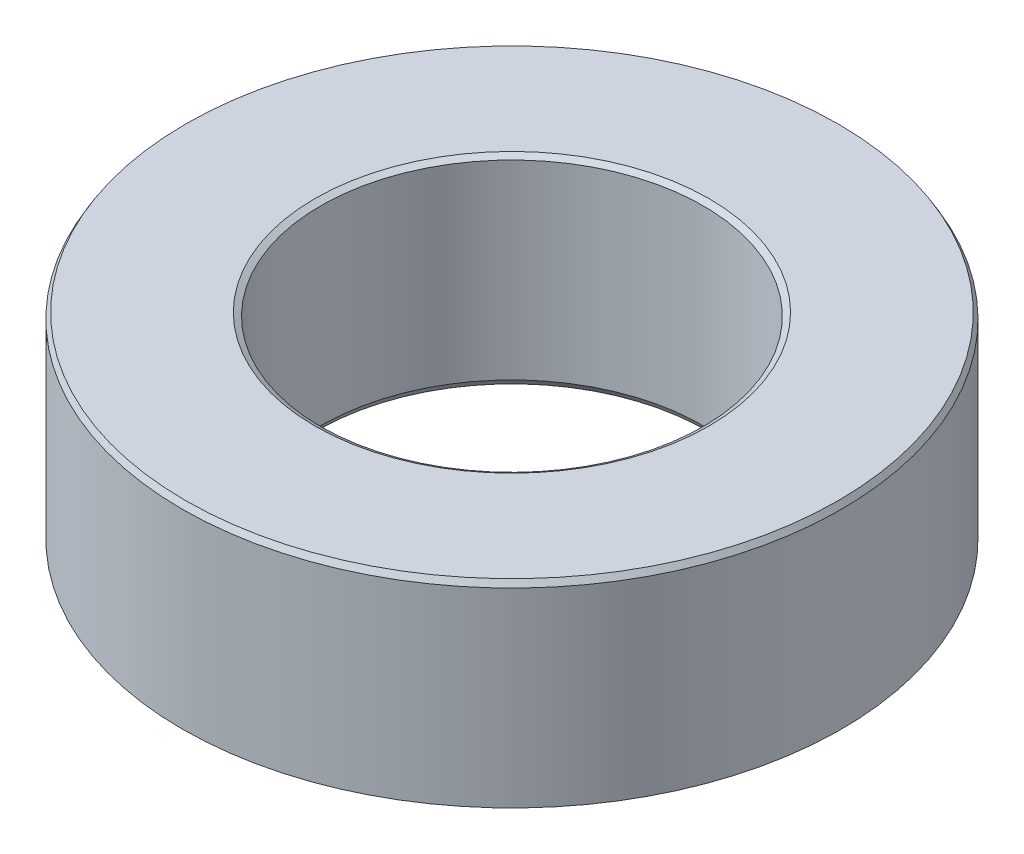
ISO-10303-21;
HEADER;
FILE_DESCRIPTION(('STEP AP214'),'2;1');
FILE_NAME('part.step','',(''),(''),'','','');
FILE_SCHEMA(('AUTOMOTIVE_DESIGN { 1 0 10303 214 1 1 1 1 }'));
ENDSEC;
DATA;
#1=APPLICATION_CONTEXT('core data for automotive mechanical design processes');
#2=APPLICATION_PROTOCOL_DEFINITION('international standard','automotive_design',2000,#1);
#3=PRODUCT_CONTEXT('',#1,'mechanical');
#4=PRODUCT('Part','Part','',(#3));
#5=PRODUCT_RELATED_PRODUCT_CATEGORY('part','',(#4));
#6=PRODUCT_DEFINITION_FORMATION('','',#4);
#7=PRODUCT_DEFINITION_CONTEXT('part definition',#1,'design');
#8=PRODUCT_DEFINITION('design','',#6,#7);
#9=PRODUCT_DEFINITION_SHAPE('','',#8);
#10=(LENGTH_UNIT() NAMED_UNIT(*) SI_UNIT(.MILLI.,.METRE.));
#11=(NAMED_UNIT(*) PLANE_ANGLE_UNIT() SI_UNIT($,.RADIAN.));
#12=(NAMED_UNIT(*) SI_UNIT($,.STERADIAN.) SOLID_ANGLE_UNIT());
#13=UNCERTAINTY_MEASURE_WITH_UNIT(LENGTH_MEASURE(1.E-05),#10,'distance_accuracy_value','');
#14=(GEOMETRIC_REPRESENTATION_CONTEXT(3) GLOBAL_UNCERTAINTY_ASSIGNED_CONTEXT((#13)) GLOBAL_UNIT_ASSIGNED_CONTEXT((#10,
#11,#12)) REPRESENTATION_CONTEXT('',''));
#15=CARTESIAN_POINT('',(0.,0.,0.));
#16=DIRECTION('',(0.,0.,1.));
#17=DIRECTION('',(1.,0.,0.));
#18=AXIS2_PLACEMENT_3D('',#15,#16,#17);
#19=CARTESIAN_POINT('',(0.,30.2769379676355,0.));
#20=DIRECTION('',(0.,-1.,0.));
#21=DIRECTION('',(0.,0.,-1.));
#22=AXIS2_PLACEMENT_3D('',#19,#20,#21);
#23=CYLINDRICAL_SURFACE('',#22,50.);
#24=CARTESIAN_POINT('',(0.,0.505990335931194,0.));
#25=DIRECTION('',(0.,1.,0.));
#26=DIRECTION('',(0.,0.,1.));
#27=AXIS2_PLACEMENT_3D('',#24,#25,#26);
#28=CIRCLE('',#27,50.);
#29=CARTESIAN_POINT('',(0.,0.505990335931194,50.));
#30=VERTEX_POINT('',#29);
#31=EDGE_CURVE('E10',#30,#30,#28,.T.);
#32=ORIENTED_EDGE('',*,*,#31,.T.);
#33=EDGE_LOOP('',(#32));
#34=FACE_BOUND('',#33,.T.);
#35=CARTESIAN_POINT('',(0.,29.4005369976638,0.));
#36=DIRECTION('',(0.,1.,0.));
#37=DIRECTION('',(0.,0.,1.));
#38=AXIS2_PLACEMENT_3D('',#35,#36,#37);
#39=CIRCLE('',#38,50.);
#40=CARTESIAN_POINT('',(0.,29.4005369976638,50.));
#41=VERTEX_POINT('',#40);
#42=EDGE_CURVE('E50',#41,#41,#39,.F.);
#43=ORIENTED_EDGE('',*,*,#42,.T.);
#44=EDGE_LOOP('',(#43));
#45=FACE_BOUND('',#44,.T.);
#46=ADVANCED_FACE('F39',(#34,#45),#23,.T.);
#47=CARTESIAN_POINT('',(0.,30.2769379676355,0.));
#48=DIRECTION('',(0.,1.,0.));
#49=DIRECTION('',(0.,0.,1.));
#50=AXIS2_PLACEMENT_3D('',#47,#48,#49);
#51=PLANE('',#50);
#52=CARTESIAN_POINT('',(0.,30.2769379676355,0.));
#53=DIRECTION('',(0.,1.,0.));
#54=DIRECTION('',(0.,0.,1.));
#55=AXIS2_PLACEMENT_3D('',#52,#53,#54);
#56=CIRCLE('',#55,29.89196064427);
#57=CARTESIAN_POINT('',(0.,30.2769379676355,29.89196064427));
#58=VERTEX_POINT('',#57);
#59=EDGE_CURVE('E58',#58,#58,#56,.F.);
#60=ORIENTED_EDGE('',*,*,#59,.T.);
#61=EDGE_LOOP('',(#60));
#62=FACE_BOUND('',#61,.T.);
#63=CARTESIAN_POINT('',(0.,30.2769379676355,0.));
#64=DIRECTION('',(0.,1.,0.));
#65=DIRECTION('',(0.,0.,1.));
#66=AXIS2_PLACEMENT_3D('',#63,#64,#65);
#67=CIRCLE('',#66,49.4940096640688);
#68=CARTESIAN_POINT('',(0.,30.2769379676355,49.4940096640688));
#69=VERTEX_POINT('',#68);
#70=EDGE_CURVE('E61',#69,#69,#67,.T.);
#71=ORIENTED_EDGE('',*,*,#70,.T.);
#72=EDGE_LOOP('',(#71));
#73=FACE_BOUND('',#72,.T.);
#74=ADVANCED_FACE('F88',(#62,#73),#51,.T.);
#75=CARTESIAN_POINT('',(0.,0.,0.));
#76=DIRECTION('',(0.,1.,0.));
#77=DIRECTION('',(0.,0.,1.));
#78=AXIS2_PLACEMENT_3D('',#75,#76,#77);
#79=PLANE('',#78);
#80=CARTESIAN_POINT('',(0.,0.,0.));
#81=DIRECTION('',(0.,1.,0.));
#82=DIRECTION('',(0.,0.,1.));
#83=AXIS2_PLACEMENT_3D('',#80,#81,#82);
#84=CIRCLE('',#83,29.5215500102294);
#85=CARTESIAN_POINT('',(0.,0.,29.5215500102294));
#86=VERTEX_POINT('',#85);
#87=EDGE_CURVE('E51',#86,#86,#84,.T.);
#88=ORIENTED_EDGE('',*,*,#87,.T.);
#89=EDGE_LOOP('',(#88));
#90=FACE_BOUND('',#89,.T.);
#91=CARTESIAN_POINT('',(0.,0.,0.));
#92=DIRECTION('',(0.,1.,0.));
#93=DIRECTION('',(0.,0.,1.));
#94=AXIS2_PLACEMENT_3D('',#91,#92,#93);
#95=CIRCLE('',#94,49.1235990300283);
#96=CARTESIAN_POINT('',(0.,0.,49.1235990300283));
#97=VERTEX_POINT('',#96);
#98=EDGE_CURVE('E54',#97,#97,#95,.F.);
#99=ORIENTED_EDGE('',*,*,#98,.T.);
#100=EDGE_LOOP('',(#99));
#101=FACE_BOUND('',#100,.T.);
#102=ADVANCED_FACE('F83',(#90,#101),#79,.F.);
#103=CARTESIAN_POINT('',(0.,30.2769379676355,0.));
#104=DIRECTION('',(0.,-1.,0.));
#105=DIRECTION('',(0.,0.,-1.));
#106=AXIS2_PLACEMENT_3D('',#103,#104,#105);
#107=CYLINDRICAL_SURFACE('',#106,29.0155596742982);
#108=CARTESIAN_POINT('',(0.,29.7709476317042,0.));
#109=DIRECTION('',(0.,1.,0.));
#110=DIRECTION('',(0.,0.,1.));
#111=AXIS2_PLACEMENT_3D('',#108,#109,#110);
#112=CIRCLE('',#111,29.0155596742982);
#113=CARTESIAN_POINT('',(0.,29.7709476317042,29.0155596742982));
#114=VERTEX_POINT('',#113);
#115=EDGE_CURVE('E67',#114,#114,#112,.T.);
#116=ORIENTED_EDGE('',*,*,#115,.T.);
#117=EDGE_LOOP('',(#116));
#118=FACE_BOUND('',#117,.T.);
#119=CARTESIAN_POINT('',(0.,0.876400969971672,0.));
#120=DIRECTION('',(0.,1.,0.));
#121=DIRECTION('',(0.,0.,1.));
#122=AXIS2_PLACEMENT_3D('',#119,#120,#121);
#123=CIRCLE('',#122,29.0155596742982);
#124=CARTESIAN_POINT('',(0.,0.876400969971672,29.0155596742982));
#125=VERTEX_POINT('',#124);
#126=EDGE_CURVE('E69',#125,#125,#123,.F.);
#127=ORIENTED_EDGE('',*,*,#126,.T.);
#128=EDGE_LOOP('',(#127));
#129=FACE_BOUND('',#128,.T.);
#130=ADVANCED_FACE('F71',(#118,#129),#107,.F.);
#131=CARTESIAN_POINT('',(0.,29.7709476317042,0.));
#132=DIRECTION('',(0.,1.,0.));
#133=DIRECTION('',(0.,0.,1.));
#134=AXIS2_PLACEMENT_3D('',#131,#132,#133);
#135=CONICAL_SURFACE('',#134,29.0155596742982,1.04719755119661);
#136=ORIENTED_EDGE('',*,*,#59,.F.);
#137=EDGE_LOOP('',(#136));
#138=FACE_BOUND('',#137,.T.);
#139=ORIENTED_EDGE('',*,*,#115,.F.);
#140=EDGE_LOOP('',(#139));
#141=FACE_BOUND('',#140,.T.);
#142=ADVANCED_FACE('F77',(#138,#141),#135,.F.);
#143=CARTESIAN_POINT('',(0.,0.,0.));
#144=DIRECTION('',(0.,-1.,0.));
#145=DIRECTION('',(0.,0.,-1.));
#146=AXIS2_PLACEMENT_3D('',#143,#144,#145);
#147=CONICAL_SURFACE('',#146,29.5215500102294,0.52359877559829);
#148=ORIENTED_EDGE('',*,*,#126,.F.);
#149=EDGE_LOOP('',(#148));
#150=FACE_BOUND('',#149,.T.);
#151=ORIENTED_EDGE('',*,*,#87,.F.);
#152=EDGE_LOOP('',(#151));
#153=FACE_BOUND('',#152,.T.);
#154=ADVANCED_FACE('F73',(#150,#153),#147,.F.);
#155=CARTESIAN_POINT('',(0.,0.505990335931194,0.));
#156=DIRECTION('',(0.,1.,0.));
#157=DIRECTION('',(0.,0.,1.));
#158=AXIS2_PLACEMENT_3D('',#155,#156,#157);
#159=CONICAL_SURFACE('',#158,50.,1.0471975511966);
#160=ORIENTED_EDGE('',*,*,#98,.F.);
#161=EDGE_LOOP('',(#160));
#162=FACE_BOUND('',#161,.T.);
#163=ORIENTED_EDGE('',*,*,#31,.F.);
#164=EDGE_LOOP('',(#163));
#165=FACE_BOUND('',#164,.T.);
#166=ADVANCED_FACE('F76',(#162,#165),#159,.T.);
#167=CARTESIAN_POINT('',(0.,30.2769379676355,0.));
#168=DIRECTION('',(0.,-1.,0.));
#169=DIRECTION('',(0.,0.,-1.));
#170=AXIS2_PLACEMENT_3D('',#167,#168,#169);
#171=CONICAL_SURFACE('',#170,49.4940096640688,0.523598775598295);
#172=ORIENTED_EDGE('',*,*,#42,.F.);
#173=EDGE_LOOP('',(#172));
#174=FACE_BOUND('',#173,.T.);
#175=ORIENTED_EDGE('',*,*,#70,.F.);
#176=EDGE_LOOP('',(#175));
#177=FACE_BOUND('',#176,.T.);
#178=ADVANCED_FACE('F45',(#174,#177),#171,.T.);
#179=CLOSED_SHELL('',(#46,#74,#102,#130,#142,#154,#166,#178));
#180=MANIFOLD_SOLID_BREP('B2',#179);
#181=ADVANCED_BREP_SHAPE_REPRESENTATION('',(#18,#180),#14);
#182=SHAPE_DEFINITION_REPRESENTATION(#9,#181);
ENDSEC;
END-ISO-10303-21;
